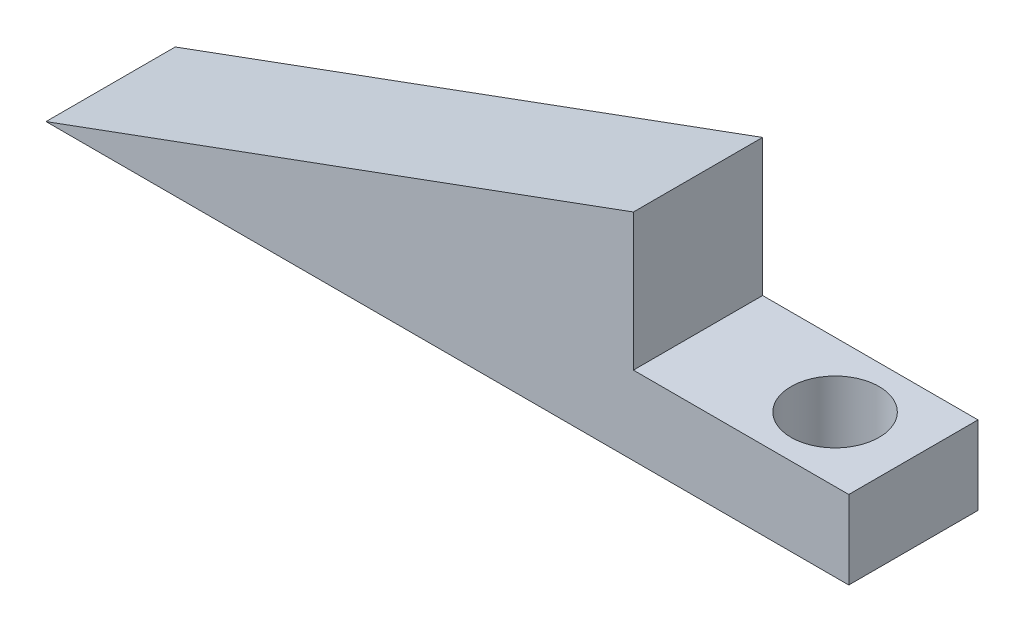
ISO-10303-21;
HEADER;
FILE_DESCRIPTION(('STEP AP214'),'2;1');
FILE_NAME('part.step','',(''),(''),'','','');
FILE_SCHEMA(('AUTOMOTIVE_DESIGN { 1 0 10303 214 1 1 1 1 }'));
ENDSEC;
DATA;
#1=APPLICATION_CONTEXT('core data for automotive mechanical design processes');
#2=APPLICATION_PROTOCOL_DEFINITION('international standard','automotive_design',2000,#1);
#3=PRODUCT_CONTEXT('',#1,'mechanical');
#4=PRODUCT('Part','Part','',(#3));
#5=PRODUCT_RELATED_PRODUCT_CATEGORY('part','',(#4));
#6=PRODUCT_DEFINITION_FORMATION('','',#4);
#7=PRODUCT_DEFINITION_CONTEXT('part definition',#1,'design');
#8=PRODUCT_DEFINITION('design','',#6,#7);
#9=PRODUCT_DEFINITION_SHAPE('','',#8);
#10=(LENGTH_UNIT() NAMED_UNIT(*) SI_UNIT(.MILLI.,.METRE.));
#11=(NAMED_UNIT(*) PLANE_ANGLE_UNIT() SI_UNIT($,.RADIAN.));
#12=(NAMED_UNIT(*) SI_UNIT($,.STERADIAN.) SOLID_ANGLE_UNIT());
#13=UNCERTAINTY_MEASURE_WITH_UNIT(LENGTH_MEASURE(1.E-05),#10,'distance_accuracy_value','');
#14=(GEOMETRIC_REPRESENTATION_CONTEXT(3) GLOBAL_UNCERTAINTY_ASSIGNED_CONTEXT((#13)) GLOBAL_UNIT_ASSIGNED_CONTEXT((#10,
#11,#12)) REPRESENTATION_CONTEXT('',''));
#15=CARTESIAN_POINT('',(0.,0.,0.));
#16=DIRECTION('',(0.,0.,1.));
#17=DIRECTION('',(1.,0.,0.));
#18=AXIS2_PLACEMENT_3D('',#15,#16,#17);
#19=CARTESIAN_POINT('',(-48.6778360140079,4.83325327227112,6.6));
#20=DIRECTION('',(-1.,0.,0.));
#21=DIRECTION('',(0.,-1.,0.));
#22=AXIS2_PLACEMENT_3D('',#19,#20,#21);
#23=PLANE('',#22);
#24=DIRECTION('',(0.,0.,1.));
#25=VECTOR('',#24,1.);
#26=CARTESIAN_POINT('',(-48.6778360140079,-2.16067767617997,6.6));
#27=LINE('',#26,#25);
#28=CARTESIAN_POINT('',(-48.6778360140079,-2.16067767617997,0.));
#29=VERTEX_POINT('',#28);
#30=CARTESIAN_POINT('',(-48.6778360140079,-2.16067767617997,6.6));
#31=VERTEX_POINT('',#30);
#32=EDGE_CURVE('E50',#29,#31,#27,.T.);
#33=ORIENTED_EDGE('',*,*,#32,.F.);
#34=DIRECTION('',(0.,1.,0.));
#35=VECTOR('',#34,1.);
#36=CARTESIAN_POINT('',(-48.6778360140079,4.83325327227112,0.));
#37=LINE('',#36,#35);
#38=CARTESIAN_POINT('',(-48.6778360140079,4.83325327227112,0.));
#39=VERTEX_POINT('',#38);
#40=EDGE_CURVE('E68',#29,#39,#37,.T.);
#41=ORIENTED_EDGE('',*,*,#40,.T.);
#42=DIRECTION('',(0.,0.,-1.));
#43=VECTOR('',#42,1.);
#44=CARTESIAN_POINT('',(-48.6778360140079,4.83325327227112,6.6));
#45=LINE('',#44,#43);
#46=CARTESIAN_POINT('',(-48.6778360140079,4.83325327227112,6.6));
#47=VERTEX_POINT('',#46);
#48=EDGE_CURVE('E43',#47,#39,#45,.T.);
#49=ORIENTED_EDGE('',*,*,#48,.F.);
#50=DIRECTION('',(0.,1.,0.));
#51=VECTOR('',#50,1.);
#52=CARTESIAN_POINT('',(-48.6778360140079,4.83325327227112,6.6));
#53=LINE('',#52,#51);
#54=EDGE_CURVE('E58',#31,#47,#53,.T.);
#55=ORIENTED_EDGE('',*,*,#54,.F.);
#56=EDGE_LOOP('',(#33,#41,#49,#55));
#57=FACE_BOUND('',#56,.T.);
#58=ADVANCED_FACE('F35',(#57),#23,.F.);
#59=CARTESIAN_POINT('',(-78.6778360140079,-6.16674672772888,6.6));
#60=DIRECTION('',(0.344254649158423,-0.938876315886609,0.));
#61=DIRECTION('',(0.938876315886609,0.344254649158423,0.));
#62=AXIS2_PLACEMENT_3D('',#59,#60,#61);
#63=PLANE('',#62);
#64=DIRECTION('',(-0.938876315886609,-0.344254649158423,0.));
#65=VECTOR('',#64,1.);
#66=CARTESIAN_POINT('',(-78.6778360140079,-6.16674672772888,0.));
#67=LINE('',#66,#65);
#68=CARTESIAN_POINT('',(-78.6778360140079,-6.16674672772888,0.));
#69=VERTEX_POINT('',#68);
#70=EDGE_CURVE('E81',#39,#69,#67,.T.);
#71=ORIENTED_EDGE('',*,*,#70,.T.);
#72=DIRECTION('',(0.,0.,-1.));
#73=VECTOR('',#72,1.);
#74=CARTESIAN_POINT('',(-78.6778360140079,-6.16674672772888,6.6));
#75=LINE('',#74,#73);
#76=CARTESIAN_POINT('',(-78.6778360140079,-6.16674672772888,6.6));
#77=VERTEX_POINT('',#76);
#78=EDGE_CURVE('E11',#77,#69,#75,.T.);
#79=ORIENTED_EDGE('',*,*,#78,.F.);
#80=DIRECTION('',(-0.938876315886609,-0.344254649158423,0.));
#81=VECTOR('',#80,1.);
#82=CARTESIAN_POINT('',(-78.6778360140079,-6.16674672772888,6.6));
#83=LINE('',#82,#81);
#84=EDGE_CURVE('E75',#47,#77,#83,.T.);
#85=ORIENTED_EDGE('',*,*,#84,.F.);
#86=ORIENTED_EDGE('',*,*,#48,.T.);
#87=EDGE_LOOP('',(#71,#79,#85,#86));
#88=FACE_BOUND('',#87,.T.);
#89=ADVANCED_FACE('F37',(#88),#63,.F.);
#90=CARTESIAN_POINT('',(-48.6778360140079,-6.16674672772888,6.6));
#91=DIRECTION('',(0.,1.,0.));
#92=DIRECTION('',(-1.,0.,0.));
#93=AXIS2_PLACEMENT_3D('',#90,#91,#92);
#94=PLANE('',#93);
#95=CARTESIAN_POINT('',(-41.6778360140079,-6.16674672772888,3.3));
#96=DIRECTION('',(0.,1.,0.));
#97=DIRECTION('',(0.,0.,1.));
#98=AXIS2_PLACEMENT_3D('',#95,#96,#97);
#99=CIRCLE('',#98,2.25);
#100=CARTESIAN_POINT('',(-41.6778360140079,-6.16674672772888,5.55));
#101=VERTEX_POINT('',#100);
#102=EDGE_CURVE('E100',#101,#101,#99,.T.);
#103=ORIENTED_EDGE('',*,*,#102,.T.);
#104=EDGE_LOOP('',(#103));
#105=FACE_BOUND('',#104,.T.);
#106=DIRECTION('',(1.,0.,0.));
#107=VECTOR('',#106,1.);
#108=CARTESIAN_POINT('',(-48.6778360140079,-6.16674672772888,0.));
#109=LINE('',#108,#107);
#110=CARTESIAN_POINT('',(-37.6778360140079,-6.16674672772885,0.));
#111=VERTEX_POINT('',#110);
#112=EDGE_CURVE('E76',#69,#111,#109,.T.);
#113=ORIENTED_EDGE('',*,*,#112,.T.);
#114=DIRECTION('',(0.,0.,-1.));
#115=VECTOR('',#114,1.);
#116=CARTESIAN_POINT('',(-37.6778360140079,-6.16674672772885,6.6));
#117=LINE('',#116,#115);
#118=CARTESIAN_POINT('',(-37.6778360140079,-6.16674672772885,6.6));
#119=VERTEX_POINT('',#118);
#120=EDGE_CURVE('E106',#119,#111,#117,.T.);
#121=ORIENTED_EDGE('',*,*,#120,.F.);
#122=DIRECTION('',(1.,0.,0.));
#123=VECTOR('',#122,1.);
#124=CARTESIAN_POINT('',(-48.6778360140079,-6.16674672772888,6.6));
#125=LINE('',#124,#123);
#126=EDGE_CURVE('E92',#77,#119,#125,.T.);
#127=ORIENTED_EDGE('',*,*,#126,.F.);
#128=ORIENTED_EDGE('',*,*,#78,.T.);
#129=EDGE_LOOP('',(#113,#121,#127,#128));
#130=FACE_BOUND('',#129,.T.);
#131=ADVANCED_FACE('F139',(#105,#130),#94,.F.);
#132=CARTESIAN_POINT('',(0.,0.,6.6));
#133=DIRECTION('',(0.,0.,-1.));
#134=DIRECTION('',(-1.,0.,0.));
#135=AXIS2_PLACEMENT_3D('',#132,#133,#134);
#136=PLANE('',#135);
#137=ORIENTED_EDGE('',*,*,#84,.T.);
#138=ORIENTED_EDGE('',*,*,#126,.T.);
#139=DIRECTION('',(0.,-1.,0.));
#140=VECTOR('',#139,1.);
#141=CARTESIAN_POINT('',(-37.6778360140079,-6.16674672772885,6.6));
#142=LINE('',#141,#140);
#143=CARTESIAN_POINT('',(-37.6778360140079,-2.16067767617997,6.6));
#144=VERTEX_POINT('',#143);
#145=EDGE_CURVE('E99',#144,#119,#142,.T.);
#146=ORIENTED_EDGE('',*,*,#145,.F.);
#147=DIRECTION('',(-1.,0.,0.));
#148=VECTOR('',#147,1.);
#149=CARTESIAN_POINT('',(-37.6778360140079,-2.16067767617997,6.6));
#150=LINE('',#149,#148);
#151=EDGE_CURVE('E88',#144,#31,#150,.T.);
#152=ORIENTED_EDGE('',*,*,#151,.T.);
#153=ORIENTED_EDGE('',*,*,#54,.T.);
#154=EDGE_LOOP('',(#137,#138,#146,#152,#153));
#155=FACE_BOUND('',#154,.T.);
#156=ADVANCED_FACE('F129',(#155),#136,.F.);
#157=CARTESIAN_POINT('',(0.,0.,0.));
#158=DIRECTION('',(0.,0.,-1.));
#159=DIRECTION('',(-1.,0.,0.));
#160=AXIS2_PLACEMENT_3D('',#157,#158,#159);
#161=PLANE('',#160);
#162=ORIENTED_EDGE('',*,*,#70,.F.);
#163=ORIENTED_EDGE('',*,*,#40,.F.);
#164=DIRECTION('',(-1.,0.,0.));
#165=VECTOR('',#164,1.);
#166=CARTESIAN_POINT('',(-37.6778360140079,-2.16067767617997,0.));
#167=LINE('',#166,#165);
#168=CARTESIAN_POINT('',(-37.6778360140079,-2.16067767617997,0.));
#169=VERTEX_POINT('',#168);
#170=EDGE_CURVE('E85',#169,#29,#167,.T.);
#171=ORIENTED_EDGE('',*,*,#170,.F.);
#172=DIRECTION('',(0.,1.,0.));
#173=VECTOR('',#172,1.);
#174=CARTESIAN_POINT('',(-37.6778360140079,-6.16674672772885,0.));
#175=LINE('',#174,#173);
#176=EDGE_CURVE('E103',#111,#169,#175,.T.);
#177=ORIENTED_EDGE('',*,*,#176,.F.);
#178=ORIENTED_EDGE('',*,*,#112,.F.);
#179=EDGE_LOOP('',(#162,#163,#171,#177,#178));
#180=FACE_BOUND('',#179,.T.);
#181=ADVANCED_FACE('F82',(#180),#161,.T.);
#182=CARTESIAN_POINT('',(-37.6778360140079,-2.16067767617997,6.6));
#183=DIRECTION('',(0.,-1.,0.));
#184=DIRECTION('',(0.,0.,-1.));
#185=AXIS2_PLACEMENT_3D('',#182,#183,#184);
#186=PLANE('',#185);
#187=CARTESIAN_POINT('',(-41.6778360140079,-2.16067767618,3.3));
#188=DIRECTION('',(0.,1.,0.));
#189=DIRECTION('',(0.,0.,1.));
#190=AXIS2_PLACEMENT_3D('',#187,#188,#189);
#191=CIRCLE('',#190,2.25);
#192=CARTESIAN_POINT('',(-41.6778360140079,-2.16067767618,5.55));
#193=VERTEX_POINT('',#192);
#194=EDGE_CURVE('E113',#193,#193,#191,.T.);
#195=ORIENTED_EDGE('',*,*,#194,.F.);
#196=EDGE_LOOP('',(#195));
#197=FACE_BOUND('',#196,.T.);
#198=ORIENTED_EDGE('',*,*,#32,.T.);
#199=ORIENTED_EDGE('',*,*,#151,.F.);
#200=DIRECTION('',(0.,0.,1.));
#201=VECTOR('',#200,1.);
#202=CARTESIAN_POINT('',(-37.6778360140079,-2.16067767617997,6.6));
#203=LINE('',#202,#201);
#204=EDGE_CURVE('E97',#169,#144,#203,.T.);
#205=ORIENTED_EDGE('',*,*,#204,.F.);
#206=ORIENTED_EDGE('',*,*,#170,.T.);
#207=EDGE_LOOP('',(#198,#199,#205,#206));
#208=FACE_BOUND('',#207,.T.);
#209=ADVANCED_FACE('F119',(#197,#208),#186,.F.);
#210=CARTESIAN_POINT('',(-37.6778360140079,0.,0.));
#211=DIRECTION('',(-1.,0.,0.));
#212=DIRECTION('',(0.,0.,1.));
#213=AXIS2_PLACEMENT_3D('',#210,#211,#212);
#214=PLANE('',#213);
#215=ORIENTED_EDGE('',*,*,#145,.T.);
#216=ORIENTED_EDGE('',*,*,#120,.T.);
#217=ORIENTED_EDGE('',*,*,#176,.T.);
#218=ORIENTED_EDGE('',*,*,#204,.T.);
#219=EDGE_LOOP('',(#215,#216,#217,#218));
#220=FACE_BOUND('',#219,.T.);
#221=ADVANCED_FACE('F122',(#220),#214,.F.);
#222=CARTESIAN_POINT('',(-41.6778360140079,-2.16067767618,3.3));
#223=DIRECTION('',(0.,1.,0.));
#224=DIRECTION('',(0.,0.,1.));
#225=AXIS2_PLACEMENT_3D('',#222,#223,#224);
#226=CYLINDRICAL_SURFACE('',#225,2.25);
#227=ORIENTED_EDGE('',*,*,#102,.F.);
#228=EDGE_LOOP('',(#227));
#229=FACE_BOUND('',#228,.T.);
#230=ORIENTED_EDGE('',*,*,#194,.T.);
#231=EDGE_LOOP('',(#230));
#232=FACE_BOUND('',#231,.T.);
#233=ADVANCED_FACE('F117',(#229,#232),#226,.F.);
#234=CLOSED_SHELL('',(#58,#89,#131,#156,#181,#209,#221,#233));
#235=MANIFOLD_SOLID_BREP('B2',#234);
#236=ADVANCED_BREP_SHAPE_REPRESENTATION('',(#18,#235),#14);
#237=SHAPE_DEFINITION_REPRESENTATION(#9,#236);
ENDSEC;
END-ISO-10303-21;
